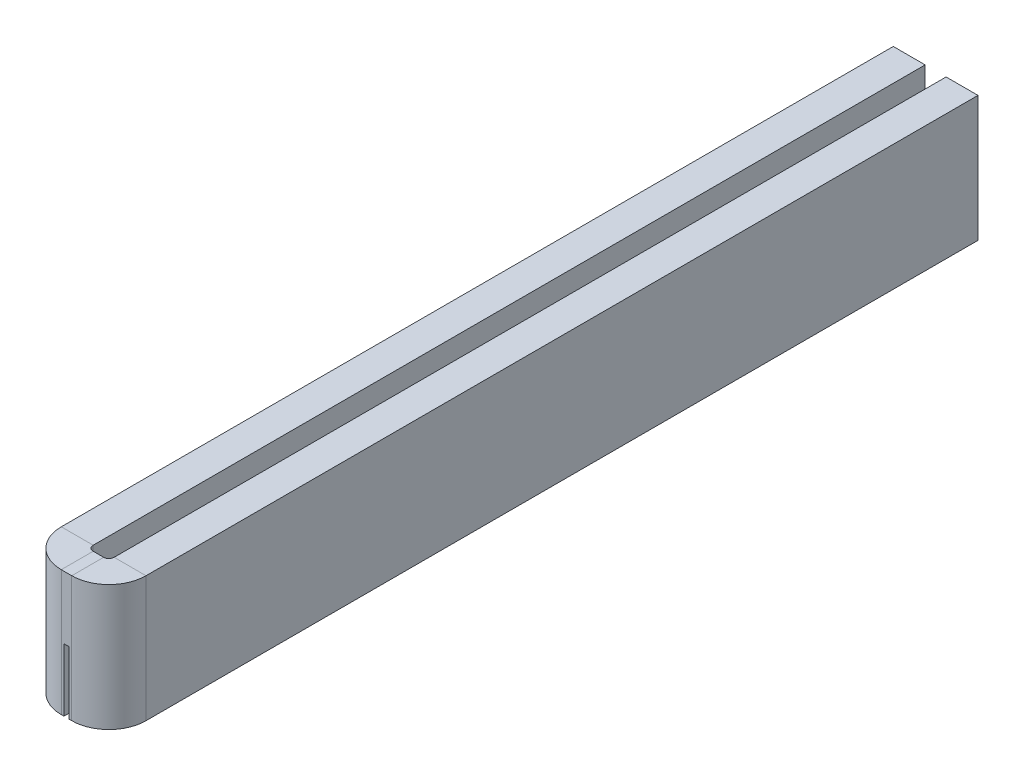
ISO-10303-21;
HEADER;
FILE_DESCRIPTION(('STEP AP214'),'2;1');
FILE_NAME('part.step','',(''),(''),'','','');
FILE_SCHEMA(('AUTOMOTIVE_DESIGN { 1 0 10303 214 1 1 1 1 }'));
ENDSEC;
DATA;
#1=APPLICATION_CONTEXT('core data for automotive mechanical design processes');
#2=APPLICATION_PROTOCOL_DEFINITION('international standard','automotive_design',2000,#1);
#3=PRODUCT_CONTEXT('',#1,'mechanical');
#4=PRODUCT('Part','Part','',(#3));
#5=PRODUCT_RELATED_PRODUCT_CATEGORY('part','',(#4));
#6=PRODUCT_DEFINITION_FORMATION('','',#4);
#7=PRODUCT_DEFINITION_CONTEXT('part definition',#1,'design');
#8=PRODUCT_DEFINITION('design','',#6,#7);
#9=PRODUCT_DEFINITION_SHAPE('','',#8);
#10=(LENGTH_UNIT() NAMED_UNIT(*) SI_UNIT(.MILLI.,.METRE.));
#11=(NAMED_UNIT(*) PLANE_ANGLE_UNIT() SI_UNIT($,.RADIAN.));
#12=(NAMED_UNIT(*) SI_UNIT($,.STERADIAN.) SOLID_ANGLE_UNIT());
#13=UNCERTAINTY_MEASURE_WITH_UNIT(LENGTH_MEASURE(1.E-05),#10,'distance_accuracy_value','');
#14=(GEOMETRIC_REPRESENTATION_CONTEXT(3) GLOBAL_UNCERTAINTY_ASSIGNED_CONTEXT((#13)) GLOBAL_UNIT_ASSIGNED_CONTEXT((#10,
#11,#12)) REPRESENTATION_CONTEXT('',''));
#15=CARTESIAN_POINT('',(0.,0.,0.));
#16=DIRECTION('',(0.,0.,1.));
#17=DIRECTION('',(1.,0.,0.));
#18=AXIS2_PLACEMENT_3D('',#15,#16,#17);
#19=CARTESIAN_POINT('',(-1.,-6.,0.));
#20=DIRECTION('',(0.,1.,0.));
#21=DIRECTION('',(1.,0.,0.));
#22=AXIS2_PLACEMENT_3D('',#19,#20,#21);
#23=PLANE('',#22);
#24=DIRECTION('',(0.,0.,1.));
#25=VECTOR('',#24,1.);
#26=CARTESIAN_POINT('',(0.250000000000001,-6.,-80.));
#27=LINE('',#26,#25);
#28=CARTESIAN_POINT('',(0.250000000000001,-6.,0.));
#29=VERTEX_POINT('',#28);
#30=CARTESIAN_POINT('',(0.250000000000001,-6.,3.048));
#31=VERTEX_POINT('',#30);
#32=EDGE_CURVE('E173',#29,#31,#27,.T.);
#33=ORIENTED_EDGE('',*,*,#32,.F.);
#34=DIRECTION('',(1.,0.,0.));
#35=VECTOR('',#34,1.);
#36=CARTESIAN_POINT('',(-1.,-6.,0.));
#37=LINE('',#36,#35);
#38=CARTESIAN_POINT('',(0.5,-6.,0.));
#39=VERTEX_POINT('',#38);
#40=EDGE_CURVE('E119',#29,#39,#37,.T.);
#41=ORIENTED_EDGE('',*,*,#40,.T.);
#42=DIRECTION('',(0.,0.,1.));
#43=VECTOR('',#42,1.);
#44=CARTESIAN_POINT('',(0.5,-6.,0.));
#45=LINE('',#44,#43);
#46=CARTESIAN_POINT('',(0.5,-6.,3.048));
#47=VERTEX_POINT('',#46);
#48=EDGE_CURVE('E296',#39,#47,#45,.T.);
#49=ORIENTED_EDGE('',*,*,#48,.T.);
#50=DIRECTION('',(-1.,0.,0.));
#51=VECTOR('',#50,1.);
#52=CARTESIAN_POINT('',(-1.,-6.,3.048));
#53=LINE('',#52,#51);
#54=EDGE_CURVE('E62',#31,#47,#53,.F.);
#55=ORIENTED_EDGE('',*,*,#54,.F.);
#56=EDGE_LOOP('',(#33,#41,#49,#55));
#57=FACE_BOUND('',#56,.T.);
#58=ADVANCED_FACE('F38',(#57),#23,.F.);
#59=DIRECTION('',(0.,0.,1.));
#60=VECTOR('',#59,1.);
#61=CARTESIAN_POINT('',(-0.250000000000001,-6.,-80.));
#62=LINE('',#61,#60);
#63=CARTESIAN_POINT('',(-0.250000000000001,-6.,0.));
#64=VERTEX_POINT('',#63);
#65=CARTESIAN_POINT('',(-0.250000000000001,-6.,3.048));
#66=VERTEX_POINT('',#65);
#67=EDGE_CURVE('E182',#64,#66,#62,.T.);
#68=ORIENTED_EDGE('',*,*,#67,.T.);
#69=CARTESIAN_POINT('',(-0.5,-6.,3.048));
#70=VERTEX_POINT('',#69);
#71=EDGE_CURVE('E215',#70,#66,#53,.F.);
#72=ORIENTED_EDGE('',*,*,#71,.F.);
#73=DIRECTION('',(0.,0.,1.));
#74=VECTOR('',#73,1.);
#75=CARTESIAN_POINT('',(-0.5,-6.,0.));
#76=LINE('',#75,#74);
#77=CARTESIAN_POINT('',(-0.5,-6.,0.));
#78=VERTEX_POINT('',#77);
#79=EDGE_CURVE('E298',#78,#70,#76,.T.);
#80=ORIENTED_EDGE('',*,*,#79,.F.);
#81=EDGE_CURVE('E242',#78,#64,#37,.T.);
#82=ORIENTED_EDGE('',*,*,#81,.T.);
#83=EDGE_LOOP('',(#68,#72,#80,#82));
#84=FACE_BOUND('',#83,.T.);
#85=ADVANCED_FACE('F330',(#84),#23,.F.);
#86=CARTESIAN_POINT('',(0.5,-6.,-0.5));
#87=DIRECTION('',(0.,1.,0.));
#88=DIRECTION('',(0.,0.,1.));
#89=AXIS2_PLACEMENT_3D('',#86,#87,#88);
#90=PLANE('',#89);
#91=ORIENTED_EDGE('',*,*,#48,.F.);
#92=CARTESIAN_POINT('',(0.5,-6.,-0.5));
#93=DIRECTION('',(0.,-1.,0.));
#94=DIRECTION('',(0.,0.,-1.));
#95=AXIS2_PLACEMENT_3D('',#92,#93,#94);
#96=CIRCLE('',#95,0.5);
#97=CARTESIAN_POINT('',(1.,-6.,-0.5));
#98=VERTEX_POINT('',#97);
#99=EDGE_CURVE('E181',#39,#98,#96,.F.);
#100=ORIENTED_EDGE('',*,*,#99,.T.);
#101=DIRECTION('',(1.,0.,0.));
#102=VECTOR('',#101,1.);
#103=CARTESIAN_POINT('',(1.,-6.,-0.5));
#104=LINE('',#103,#102);
#105=CARTESIAN_POINT('',(4.048,-6.,-0.5));
#106=VERTEX_POINT('',#105);
#107=EDGE_CURVE('E293',#98,#106,#104,.T.);
#108=ORIENTED_EDGE('',*,*,#107,.T.);
#109=CARTESIAN_POINT('',(0.5,-6.,-0.5));
#110=DIRECTION('',(0.,-1.,0.));
#111=DIRECTION('',(0.,0.,-1.));
#112=AXIS2_PLACEMENT_3D('',#109,#110,#111);
#113=CIRCLE('',#112,3.548);
#114=EDGE_CURVE('E219',#47,#106,#113,.F.);
#115=ORIENTED_EDGE('',*,*,#114,.F.);
#116=EDGE_LOOP('',(#91,#100,#108,#115));
#117=FACE_BOUND('',#116,.T.);
#118=ADVANCED_FACE('F311',(#117),#90,.F.);
#119=CARTESIAN_POINT('',(1.,-6.,0.));
#120=DIRECTION('',(0.,1.,0.));
#121=DIRECTION('',(0.,0.,-1.));
#122=AXIS2_PLACEMENT_3D('',#119,#120,#121);
#123=PLANE('',#122);
#124=ORIENTED_EDGE('',*,*,#107,.F.);
#125=DIRECTION('',(0.,0.,-1.));
#126=VECTOR('',#125,1.);
#127=CARTESIAN_POINT('',(1.,-6.,0.));
#128=LINE('',#127,#126);
#129=CARTESIAN_POINT('',(1.,-6.,-80.));
#130=VERTEX_POINT('',#129);
#131=EDGE_CURVE('E233',#98,#130,#128,.T.);
#132=ORIENTED_EDGE('',*,*,#131,.T.);
#133=DIRECTION('',(1.,0.,0.));
#134=VECTOR('',#133,1.);
#135=CARTESIAN_POINT('',(1.,-6.,-80.));
#136=LINE('',#135,#134);
#137=CARTESIAN_POINT('',(4.048,-6.,-80.));
#138=VERTEX_POINT('',#137);
#139=EDGE_CURVE('E126',#130,#138,#136,.T.);
#140=ORIENTED_EDGE('',*,*,#139,.T.);
#141=DIRECTION('',(0.,0.,1.));
#142=VECTOR('',#141,1.);
#143=CARTESIAN_POINT('',(4.048,-6.,0.));
#144=LINE('',#143,#142);
#145=EDGE_CURVE('E211',#106,#138,#144,.F.);
#146=ORIENTED_EDGE('',*,*,#145,.F.);
#147=EDGE_LOOP('',(#124,#132,#140,#146));
#148=FACE_BOUND('',#147,.T.);
#149=ADVANCED_FACE('F372',(#148),#123,.F.);
#150=CARTESIAN_POINT('',(1.,6.,-80.));
#151=DIRECTION('',(0.,0.,-1.));
#152=DIRECTION('',(0.,-1.,0.));
#153=AXIS2_PLACEMENT_3D('',#150,#151,#152);
#154=PLANE('',#153);
#155=ORIENTED_EDGE('',*,*,#139,.F.);
#156=DIRECTION('',(0.,-1.,0.));
#157=VECTOR('',#156,1.);
#158=CARTESIAN_POINT('',(1.,6.,-80.));
#159=LINE('',#158,#157);
#160=CARTESIAN_POINT('',(1.,6.,-80.));
#161=VERTEX_POINT('',#160);
#162=EDGE_CURVE('E235',#161,#130,#159,.T.);
#163=ORIENTED_EDGE('',*,*,#162,.F.);
#164=DIRECTION('',(1.,0.,0.));
#165=VECTOR('',#164,1.);
#166=CARTESIAN_POINT('',(1.,6.,-80.));
#167=LINE('',#166,#165);
#168=CARTESIAN_POINT('',(4.048,6.,-80.));
#169=VERTEX_POINT('',#168);
#170=EDGE_CURVE('E290',#161,#169,#167,.T.);
#171=ORIENTED_EDGE('',*,*,#170,.T.);
#172=DIRECTION('',(0.,1.,0.));
#173=VECTOR('',#172,1.);
#174=CARTESIAN_POINT('',(4.048,6.,-80.));
#175=LINE('',#174,#173);
#176=EDGE_CURVE('E223',#169,#138,#175,.F.);
#177=ORIENTED_EDGE('',*,*,#176,.T.);
#178=EDGE_LOOP('',(#155,#163,#171,#177));
#179=FACE_BOUND('',#178,.T.);
#180=ADVANCED_FACE('F368',(#179),#154,.T.);
#181=CARTESIAN_POINT('',(1.,6.,0.));
#182=DIRECTION('',(0.,1.,0.));
#183=DIRECTION('',(0.,0.,-1.));
#184=AXIS2_PLACEMENT_3D('',#181,#182,#183);
#185=PLANE('',#184);
#186=ORIENTED_EDGE('',*,*,#170,.F.);
#187=DIRECTION('',(0.,0.,-1.));
#188=VECTOR('',#187,1.);
#189=CARTESIAN_POINT('',(1.,6.,0.));
#190=LINE('',#189,#188);
#191=CARTESIAN_POINT('',(1.,6.,-0.5));
#192=VERTEX_POINT('',#191);
#193=EDGE_CURVE('E239',#192,#161,#190,.T.);
#194=ORIENTED_EDGE('',*,*,#193,.F.);
#195=DIRECTION('',(1.,0.,0.));
#196=VECTOR('',#195,1.);
#197=CARTESIAN_POINT('',(1.,6.,-0.5));
#198=LINE('',#197,#196);
#199=CARTESIAN_POINT('',(4.048,6.,-0.5));
#200=VERTEX_POINT('',#199);
#201=EDGE_CURVE('E288',#192,#200,#198,.T.);
#202=ORIENTED_EDGE('',*,*,#201,.T.);
#203=DIRECTION('',(0.,0.,1.));
#204=VECTOR('',#203,1.);
#205=CARTESIAN_POINT('',(4.048,6.,0.));
#206=LINE('',#205,#204);
#207=EDGE_CURVE('E220',#200,#169,#206,.F.);
#208=ORIENTED_EDGE('',*,*,#207,.T.);
#209=EDGE_LOOP('',(#186,#194,#202,#208));
#210=FACE_BOUND('',#209,.T.);
#211=ADVANCED_FACE('F362',(#210),#185,.T.);
#212=CARTESIAN_POINT('',(0.5,6.,-0.5));
#213=DIRECTION('',(0.,-1.,0.));
#214=DIRECTION('',(0.,0.,-1.));
#215=AXIS2_PLACEMENT_3D('',#212,#213,#214);
#216=PLANE('',#215);
#217=ORIENTED_EDGE('',*,*,#201,.F.);
#218=CARTESIAN_POINT('',(0.5,6.,-0.5));
#219=DIRECTION('',(0.,1.,0.));
#220=DIRECTION('',(0.,0.,1.));
#221=AXIS2_PLACEMENT_3D('',#218,#219,#220);
#222=CIRCLE('',#221,0.5);
#223=CARTESIAN_POINT('',(0.5,6.,0.));
#224=VERTEX_POINT('',#223);
#225=EDGE_CURVE('E267',#192,#224,#222,.F.);
#226=ORIENTED_EDGE('',*,*,#225,.T.);
#227=DIRECTION('',(0.,0.,1.));
#228=VECTOR('',#227,1.);
#229=CARTESIAN_POINT('',(0.5,6.,0.));
#230=LINE('',#229,#228);
#231=CARTESIAN_POINT('',(0.5,6.,3.048));
#232=VERTEX_POINT('',#231);
#233=EDGE_CURVE('E286',#224,#232,#230,.T.);
#234=ORIENTED_EDGE('',*,*,#233,.T.);
#235=CARTESIAN_POINT('',(0.5,6.,-0.5));
#236=DIRECTION('',(0.,-1.,0.));
#237=DIRECTION('',(0.,0.,-1.));
#238=AXIS2_PLACEMENT_3D('',#235,#236,#237);
#239=CIRCLE('',#238,3.548);
#240=EDGE_CURVE('E216',#200,#232,#239,.T.);
#241=ORIENTED_EDGE('',*,*,#240,.F.);
#242=EDGE_LOOP('',(#217,#226,#234,#241));
#243=FACE_BOUND('',#242,.T.);
#244=ADVANCED_FACE('F355',(#243),#216,.F.);
#245=CARTESIAN_POINT('',(-1.,6.,0.));
#246=DIRECTION('',(0.,1.,0.));
#247=DIRECTION('',(1.,0.,0.));
#248=AXIS2_PLACEMENT_3D('',#245,#246,#247);
#249=PLANE('',#248);
#250=ORIENTED_EDGE('',*,*,#233,.F.);
#251=DIRECTION('',(1.,0.,0.));
#252=VECTOR('',#251,1.);
#253=CARTESIAN_POINT('',(-1.,6.,0.));
#254=LINE('',#253,#252);
#255=CARTESIAN_POINT('',(-0.5,6.,0.));
#256=VERTEX_POINT('',#255);
#257=EDGE_CURVE('E245',#256,#224,#254,.T.);
#258=ORIENTED_EDGE('',*,*,#257,.F.);
#259=DIRECTION('',(0.,0.,1.));
#260=VECTOR('',#259,1.);
#261=CARTESIAN_POINT('',(-0.5,6.,0.));
#262=LINE('',#261,#260);
#263=CARTESIAN_POINT('',(-0.5,6.,3.048));
#264=VERTEX_POINT('',#263);
#265=EDGE_CURVE('E284',#256,#264,#262,.T.);
#266=ORIENTED_EDGE('',*,*,#265,.T.);
#267=DIRECTION('',(-1.,0.,0.));
#268=VECTOR('',#267,1.);
#269=CARTESIAN_POINT('',(-1.,6.,3.048));
#270=LINE('',#269,#268);
#271=EDGE_CURVE('E203',#264,#232,#270,.F.);
#272=ORIENTED_EDGE('',*,*,#271,.T.);
#273=EDGE_LOOP('',(#250,#258,#266,#272));
#274=FACE_BOUND('',#273,.T.);
#275=ADVANCED_FACE('F351',(#274),#249,.T.);
#276=CARTESIAN_POINT('',(-0.5,6.,-0.5));
#277=DIRECTION('',(0.,-1.,0.));
#278=DIRECTION('',(0.,0.,-1.));
#279=AXIS2_PLACEMENT_3D('',#276,#277,#278);
#280=PLANE('',#279);
#281=ORIENTED_EDGE('',*,*,#265,.F.);
#282=CARTESIAN_POINT('',(-0.5,6.,-0.5));
#283=DIRECTION('',(0.,1.,0.));
#284=DIRECTION('',(0.,0.,1.));
#285=AXIS2_PLACEMENT_3D('',#282,#283,#284);
#286=CIRCLE('',#285,0.5);
#287=CARTESIAN_POINT('',(-1.,6.,-0.5));
#288=VERTEX_POINT('',#287);
#289=EDGE_CURVE('E236',#256,#288,#286,.F.);
#290=ORIENTED_EDGE('',*,*,#289,.T.);
#291=DIRECTION('',(-1.,0.,0.));
#292=VECTOR('',#291,1.);
#293=CARTESIAN_POINT('',(-1.,6.,-0.5));
#294=LINE('',#293,#292);
#295=CARTESIAN_POINT('',(-4.048,6.,-0.499999999999999));
#296=VERTEX_POINT('',#295);
#297=EDGE_CURVE('E282',#288,#296,#294,.T.);
#298=ORIENTED_EDGE('',*,*,#297,.T.);
#299=CARTESIAN_POINT('',(-0.5,6.,-0.5));
#300=DIRECTION('',(0.,-1.,0.));
#301=DIRECTION('',(0.,0.,-1.));
#302=AXIS2_PLACEMENT_3D('',#299,#300,#301);
#303=CIRCLE('',#302,3.548);
#304=EDGE_CURVE('E208',#264,#296,#303,.T.);
#305=ORIENTED_EDGE('',*,*,#304,.F.);
#306=EDGE_LOOP('',(#281,#290,#298,#305));
#307=FACE_BOUND('',#306,.T.);
#308=ADVANCED_FACE('F321',(#307),#280,.F.);
#309=CARTESIAN_POINT('',(-1.,6.,0.));
#310=DIRECTION('',(0.,1.,0.));
#311=DIRECTION('',(0.,0.,1.));
#312=AXIS2_PLACEMENT_3D('',#309,#310,#311);
#313=PLANE('',#312);
#314=ORIENTED_EDGE('',*,*,#297,.F.);
#315=DIRECTION('',(0.,0.,1.));
#316=VECTOR('',#315,1.);
#317=CARTESIAN_POINT('',(-1.,6.,0.));
#318=LINE('',#317,#316);
#319=CARTESIAN_POINT('',(-1.,6.,-80.));
#320=VERTEX_POINT('',#319);
#321=EDGE_CURVE('E251',#320,#288,#318,.T.);
#322=ORIENTED_EDGE('',*,*,#321,.F.);
#323=DIRECTION('',(-1.,0.,0.));
#324=VECTOR('',#323,1.);
#325=CARTESIAN_POINT('',(-1.,6.,-80.));
#326=LINE('',#325,#324);
#327=CARTESIAN_POINT('',(-4.048,6.,-80.));
#328=VERTEX_POINT('',#327);
#329=EDGE_CURVE('E280',#320,#328,#326,.T.);
#330=ORIENTED_EDGE('',*,*,#329,.T.);
#331=DIRECTION('',(0.,0.,-1.));
#332=VECTOR('',#331,1.);
#333=CARTESIAN_POINT('',(-4.048,6.,0.));
#334=LINE('',#333,#332);
#335=EDGE_CURVE('E202',#328,#296,#334,.F.);
#336=ORIENTED_EDGE('',*,*,#335,.T.);
#337=EDGE_LOOP('',(#314,#322,#330,#336));
#338=FACE_BOUND('',#337,.T.);
#339=ADVANCED_FACE('F349',(#338),#313,.T.);
#340=CARTESIAN_POINT('',(-1.,6.,-80.));
#341=DIRECTION('',(0.,0.,1.));
#342=DIRECTION('',(0.,-1.,0.));
#343=AXIS2_PLACEMENT_3D('',#340,#341,#342);
#344=PLANE('',#343);
#345=ORIENTED_EDGE('',*,*,#329,.F.);
#346=DIRECTION('',(0.,-1.,0.));
#347=VECTOR('',#346,1.);
#348=CARTESIAN_POINT('',(-1.,6.,-80.));
#349=LINE('',#348,#347);
#350=CARTESIAN_POINT('',(-1.,-6.,-80.));
#351=VERTEX_POINT('',#350);
#352=EDGE_CURVE('E254',#320,#351,#349,.T.);
#353=ORIENTED_EDGE('',*,*,#352,.T.);
#354=DIRECTION('',(-1.,0.,0.));
#355=VECTOR('',#354,1.);
#356=CARTESIAN_POINT('',(-1.,-6.,-80.));
#357=LINE('',#356,#355);
#358=CARTESIAN_POINT('',(-4.048,-6.,-80.));
#359=VERTEX_POINT('',#358);
#360=EDGE_CURVE('E278',#351,#359,#357,.T.);
#361=ORIENTED_EDGE('',*,*,#360,.T.);
#362=DIRECTION('',(0.,1.,0.));
#363=VECTOR('',#362,1.);
#364=CARTESIAN_POINT('',(-4.048,6.,-80.));
#365=LINE('',#364,#363);
#366=EDGE_CURVE('E193',#328,#359,#365,.F.);
#367=ORIENTED_EDGE('',*,*,#366,.F.);
#368=EDGE_LOOP('',(#345,#353,#361,#367));
#369=FACE_BOUND('',#368,.T.);
#370=ADVANCED_FACE('F344',(#369),#344,.F.);
#371=CARTESIAN_POINT('',(-1.,-6.,0.));
#372=DIRECTION('',(0.,1.,0.));
#373=DIRECTION('',(0.,0.,1.));
#374=AXIS2_PLACEMENT_3D('',#371,#372,#373);
#375=PLANE('',#374);
#376=ORIENTED_EDGE('',*,*,#360,.F.);
#377=DIRECTION('',(0.,0.,1.));
#378=VECTOR('',#377,1.);
#379=CARTESIAN_POINT('',(-1.,-6.,0.));
#380=LINE('',#379,#378);
#381=CARTESIAN_POINT('',(-1.,-6.,-0.5));
#382=VERTEX_POINT('',#381);
#383=EDGE_CURVE('E248',#351,#382,#380,.T.);
#384=ORIENTED_EDGE('',*,*,#383,.T.);
#385=DIRECTION('',(-1.,0.,0.));
#386=VECTOR('',#385,1.);
#387=CARTESIAN_POINT('',(-1.,-6.,-0.5));
#388=LINE('',#387,#386);
#389=CARTESIAN_POINT('',(-4.048,-6.,-0.5));
#390=VERTEX_POINT('',#389);
#391=EDGE_CURVE('E196',#382,#390,#388,.T.);
#392=ORIENTED_EDGE('',*,*,#391,.T.);
#393=DIRECTION('',(0.,0.,-1.));
#394=VECTOR('',#393,1.);
#395=CARTESIAN_POINT('',(-4.048,-6.,0.));
#396=LINE('',#395,#394);
#397=EDGE_CURVE('E199',#359,#390,#396,.F.);
#398=ORIENTED_EDGE('',*,*,#397,.F.);
#399=EDGE_LOOP('',(#376,#384,#392,#398));
#400=FACE_BOUND('',#399,.T.);
#401=ADVANCED_FACE('F338',(#400),#375,.F.);
#402=CARTESIAN_POINT('',(-0.5,-6.,-0.5));
#403=DIRECTION('',(0.,1.,0.));
#404=DIRECTION('',(0.,0.,1.));
#405=AXIS2_PLACEMENT_3D('',#402,#403,#404);
#406=PLANE('',#405);
#407=CARTESIAN_POINT('',(-0.5,-6.,-0.5));
#408=DIRECTION('',(0.,-1.,0.));
#409=DIRECTION('',(0.,0.,-1.));
#410=AXIS2_PLACEMENT_3D('',#407,#408,#409);
#411=CIRCLE('',#410,0.5);
#412=EDGE_CURVE('E264',#382,#78,#411,.F.);
#413=ORIENTED_EDGE('',*,*,#412,.T.);
#414=ORIENTED_EDGE('',*,*,#79,.T.);
#415=CARTESIAN_POINT('',(-0.5,-6.,-0.5));
#416=DIRECTION('',(0.,-1.,0.));
#417=DIRECTION('',(0.,0.,-1.));
#418=AXIS2_PLACEMENT_3D('',#415,#416,#417);
#419=CIRCLE('',#418,3.548);
#420=EDGE_CURVE('E212',#390,#70,#419,.F.);
#421=ORIENTED_EDGE('',*,*,#420,.F.);
#422=ORIENTED_EDGE('',*,*,#391,.F.);
#423=EDGE_LOOP('',(#413,#414,#421,#422));
#424=FACE_BOUND('',#423,.T.);
#425=ADVANCED_FACE('F40',(#424),#406,.F.);
#426=CARTESIAN_POINT('',(-4.048,6.,0.));
#427=DIRECTION('',(1.,0.,0.));
#428=DIRECTION('',(0.,0.,-1.));
#429=AXIS2_PLACEMENT_3D('',#426,#427,#428);
#430=PLANE('',#429);
#431=ORIENTED_EDGE('',*,*,#397,.T.);
#432=DIRECTION('',(0.,1.,0.));
#433=VECTOR('',#432,1.);
#434=CARTESIAN_POINT('',(-4.048,6.,-0.5));
#435=LINE('',#434,#433);
#436=EDGE_CURVE('E186',#390,#296,#435,.T.);
#437=ORIENTED_EDGE('',*,*,#436,.T.);
#438=ORIENTED_EDGE('',*,*,#335,.F.);
#439=ORIENTED_EDGE('',*,*,#366,.T.);
#440=EDGE_LOOP('',(#431,#437,#438,#439));
#441=FACE_BOUND('',#440,.T.);
#442=ADVANCED_FACE('F477',(#441),#430,.F.);
#443=CARTESIAN_POINT('',(-1.,6.,3.048));
#444=DIRECTION('',(0.,0.,-1.));
#445=DIRECTION('',(-1.,0.,0.));
#446=AXIS2_PLACEMENT_3D('',#443,#444,#445);
#447=PLANE('',#446);
#448=DIRECTION('',(-1.,0.,0.));
#449=VECTOR('',#448,1.);
#450=CARTESIAN_POINT('',(0.25,0.,3.048));
#451=LINE('',#450,#449);
#452=CARTESIAN_POINT('',(0.25,0.,3.048));
#453=VERTEX_POINT('',#452);
#454=CARTESIAN_POINT('',(-0.25,0.,3.048));
#455=VERTEX_POINT('',#454);
#456=EDGE_CURVE('E163',#453,#455,#451,.T.);
#457=ORIENTED_EDGE('',*,*,#456,.F.);
#458=DIRECTION('',(0.,1.,0.));
#459=VECTOR('',#458,1.);
#460=CARTESIAN_POINT('',(0.25,0.,3.048));
#461=LINE('',#460,#459);
#462=EDGE_CURVE('E171',#31,#453,#461,.T.);
#463=ORIENTED_EDGE('',*,*,#462,.F.);
#464=ORIENTED_EDGE('',*,*,#54,.T.);
#465=DIRECTION('',(0.,1.,0.));
#466=VECTOR('',#465,1.);
#467=CARTESIAN_POINT('',(0.5,6.,3.048));
#468=LINE('',#467,#466);
#469=EDGE_CURVE('E194',#47,#232,#468,.T.);
#470=ORIENTED_EDGE('',*,*,#469,.T.);
#471=ORIENTED_EDGE('',*,*,#271,.F.);
#472=DIRECTION('',(0.,1.,0.));
#473=VECTOR('',#472,1.);
#474=CARTESIAN_POINT('',(-0.5,6.,3.048));
#475=LINE('',#474,#473);
#476=EDGE_CURVE('E190',#264,#70,#475,.F.);
#477=ORIENTED_EDGE('',*,*,#476,.T.);
#478=ORIENTED_EDGE('',*,*,#71,.T.);
#479=DIRECTION('',(0.,-1.,0.));
#480=VECTOR('',#479,1.);
#481=CARTESIAN_POINT('',(-0.25,0.,3.048));
#482=LINE('',#481,#480);
#483=EDGE_CURVE('E169',#455,#66,#482,.T.);
#484=ORIENTED_EDGE('',*,*,#483,.F.);
#485=EDGE_LOOP('',(#457,#463,#464,#470,#471,#477,#478,#484));
#486=FACE_BOUND('',#485,.T.);
#487=ADVANCED_FACE('F175',(#486),#447,.F.);
#488=CARTESIAN_POINT('',(4.048,6.,0.));
#489=DIRECTION('',(-1.,0.,0.));
#490=DIRECTION('',(0.,0.,1.));
#491=AXIS2_PLACEMENT_3D('',#488,#489,#490);
#492=PLANE('',#491);
#493=ORIENTED_EDGE('',*,*,#207,.F.);
#494=DIRECTION('',(0.,1.,0.));
#495=VECTOR('',#494,1.);
#496=CARTESIAN_POINT('',(4.048,6.,-0.5));
#497=LINE('',#496,#495);
#498=EDGE_CURVE('E189',#200,#106,#497,.F.);
#499=ORIENTED_EDGE('',*,*,#498,.T.);
#500=ORIENTED_EDGE('',*,*,#145,.T.);
#501=ORIENTED_EDGE('',*,*,#176,.F.);
#502=EDGE_LOOP('',(#493,#499,#500,#501));
#503=FACE_BOUND('',#502,.T.);
#504=ADVANCED_FACE('F371',(#503),#492,.F.);
#505=CARTESIAN_POINT('',(-0.5,6.,-0.5));
#506=DIRECTION('',(0.,-1.,0.));
#507=DIRECTION('',(0.,0.,-1.));
#508=AXIS2_PLACEMENT_3D('',#505,#506,#507);
#509=CYLINDRICAL_SURFACE('',#508,3.548);
#510=ORIENTED_EDGE('',*,*,#304,.T.);
#511=ORIENTED_EDGE('',*,*,#436,.F.);
#512=ORIENTED_EDGE('',*,*,#420,.T.);
#513=ORIENTED_EDGE('',*,*,#476,.F.);
#514=EDGE_LOOP('',(#510,#511,#512,#513));
#515=FACE_BOUND('',#514,.T.);
#516=ADVANCED_FACE('F325',(#515),#509,.T.);
#517=CARTESIAN_POINT('',(0.5,6.,-0.5));
#518=DIRECTION('',(0.,-1.,0.));
#519=DIRECTION('',(0.,0.,-1.));
#520=AXIS2_PLACEMENT_3D('',#517,#518,#519);
#521=CYLINDRICAL_SURFACE('',#520,3.548);
#522=ORIENTED_EDGE('',*,*,#240,.T.);
#523=ORIENTED_EDGE('',*,*,#469,.F.);
#524=ORIENTED_EDGE('',*,*,#114,.T.);
#525=ORIENTED_EDGE('',*,*,#498,.F.);
#526=EDGE_LOOP('',(#522,#523,#524,#525));
#527=FACE_BOUND('',#526,.T.);
#528=ADVANCED_FACE('F314',(#527),#521,.T.);
#529=CARTESIAN_POINT('',(-1.,6.,0.));
#530=DIRECTION('',(1.,0.,0.));
#531=DIRECTION('',(0.,0.,-1.));
#532=AXIS2_PLACEMENT_3D('',#529,#530,#531);
#533=PLANE('',#532);
#534=ORIENTED_EDGE('',*,*,#383,.F.);
#535=ORIENTED_EDGE('',*,*,#352,.F.);
#536=ORIENTED_EDGE('',*,*,#321,.T.);
#537=DIRECTION('',(0.,-1.,0.));
#538=VECTOR('',#537,1.);
#539=CARTESIAN_POINT('',(-1.,6.,-0.5));
#540=LINE('',#539,#538);
#541=EDGE_CURVE('E260',#382,#288,#540,.F.);
#542=ORIENTED_EDGE('',*,*,#541,.F.);
#543=EDGE_LOOP('',(#534,#535,#536,#542));
#544=FACE_BOUND('',#543,.T.);
#545=ADVANCED_FACE('F342',(#544),#533,.T.);
#546=CARTESIAN_POINT('',(-1.,6.,0.));
#547=DIRECTION('',(0.,0.,-1.));
#548=DIRECTION('',(-1.,0.,0.));
#549=AXIS2_PLACEMENT_3D('',#546,#547,#548);
#550=PLANE('',#549);
#551=DIRECTION('',(0.,-1.,0.));
#552=VECTOR('',#551,1.);
#553=CARTESIAN_POINT('',(0.249999999999999,6.,0.));
#554=LINE('',#553,#552);
#555=CARTESIAN_POINT('',(0.25,0.,0.));
#556=VERTEX_POINT('',#555);
#557=EDGE_CURVE('E11',#556,#29,#554,.T.);
#558=ORIENTED_EDGE('',*,*,#557,.F.);
#559=DIRECTION('',(1.,0.,0.));
#560=VECTOR('',#559,1.);
#561=CARTESIAN_POINT('',(-1.,0.,0.));
#562=LINE('',#561,#560);
#563=CARTESIAN_POINT('',(-0.25,0.,0.));
#564=VERTEX_POINT('',#563);
#565=EDGE_CURVE('E166',#564,#556,#562,.T.);
#566=ORIENTED_EDGE('',*,*,#565,.F.);
#567=DIRECTION('',(0.,1.,0.));
#568=VECTOR('',#567,1.);
#569=CARTESIAN_POINT('',(-0.249999999999999,6.,0.));
#570=LINE('',#569,#568);
#571=EDGE_CURVE('E46',#64,#564,#570,.T.);
#572=ORIENTED_EDGE('',*,*,#571,.F.);
#573=ORIENTED_EDGE('',*,*,#81,.F.);
#574=DIRECTION('',(0.,-1.,0.));
#575=VECTOR('',#574,1.);
#576=CARTESIAN_POINT('',(-0.5,6.,0.));
#577=LINE('',#576,#575);
#578=EDGE_CURVE('E257',#256,#78,#577,.T.);
#579=ORIENTED_EDGE('',*,*,#578,.F.);
#580=ORIENTED_EDGE('',*,*,#257,.T.);
#581=DIRECTION('',(0.,-1.,0.));
#582=VECTOR('',#581,1.);
#583=CARTESIAN_POINT('',(0.5,6.,0.));
#584=LINE('',#583,#582);
#585=EDGE_CURVE('E229',#39,#224,#584,.F.);
#586=ORIENTED_EDGE('',*,*,#585,.F.);
#587=ORIENTED_EDGE('',*,*,#40,.F.);
#588=EDGE_LOOP('',(#558,#566,#572,#573,#579,#580,#586,#587));
#589=FACE_BOUND('',#588,.T.);
#590=ADVANCED_FACE('F306',(#589),#550,.T.);
#591=CARTESIAN_POINT('',(1.,6.,0.));
#592=DIRECTION('',(-1.,0.,0.));
#593=DIRECTION('',(0.,0.,1.));
#594=AXIS2_PLACEMENT_3D('',#591,#592,#593);
#595=PLANE('',#594);
#596=ORIENTED_EDGE('',*,*,#193,.T.);
#597=ORIENTED_EDGE('',*,*,#162,.T.);
#598=ORIENTED_EDGE('',*,*,#131,.F.);
#599=DIRECTION('',(0.,-1.,0.));
#600=VECTOR('',#599,1.);
#601=CARTESIAN_POINT('',(1.,6.,-0.5));
#602=LINE('',#601,#600);
#603=EDGE_CURVE('E263',#192,#98,#602,.T.);
#604=ORIENTED_EDGE('',*,*,#603,.F.);
#605=EDGE_LOOP('',(#596,#597,#598,#604));
#606=FACE_BOUND('',#605,.T.);
#607=ADVANCED_FACE('F366',(#606),#595,.T.);
#608=CARTESIAN_POINT('',(-0.5,6.,-0.5));
#609=DIRECTION('',(0.,-1.,0.));
#610=DIRECTION('',(0.,0.,-1.));
#611=AXIS2_PLACEMENT_3D('',#608,#609,#610);
#612=CYLINDRICAL_SURFACE('',#611,0.5);
#613=ORIENTED_EDGE('',*,*,#289,.F.);
#614=ORIENTED_EDGE('',*,*,#578,.T.);
#615=ORIENTED_EDGE('',*,*,#412,.F.);
#616=ORIENTED_EDGE('',*,*,#541,.T.);
#617=EDGE_LOOP('',(#613,#614,#615,#616));
#618=FACE_BOUND('',#617,.T.);
#619=ADVANCED_FACE('F335',(#618),#612,.F.);
#620=CARTESIAN_POINT('',(0.5,6.,-0.5));
#621=DIRECTION('',(0.,-1.,0.));
#622=DIRECTION('',(0.,0.,-1.));
#623=AXIS2_PLACEMENT_3D('',#620,#621,#622);
#624=CYLINDRICAL_SURFACE('',#623,0.5);
#625=ORIENTED_EDGE('',*,*,#225,.F.);
#626=ORIENTED_EDGE('',*,*,#603,.T.);
#627=ORIENTED_EDGE('',*,*,#99,.F.);
#628=ORIENTED_EDGE('',*,*,#585,.T.);
#629=EDGE_LOOP('',(#625,#626,#627,#628));
#630=FACE_BOUND('',#629,.T.);
#631=ADVANCED_FACE('F359',(#630),#624,.F.);
#632=CARTESIAN_POINT('',(0.25,0.,-80.));
#633=DIRECTION('',(1.,0.,0.));
#634=DIRECTION('',(0.,1.,0.));
#635=AXIS2_PLACEMENT_3D('',#632,#633,#634);
#636=PLANE('',#635);
#637=ORIENTED_EDGE('',*,*,#557,.T.);
#638=ORIENTED_EDGE('',*,*,#32,.T.);
#639=ORIENTED_EDGE('',*,*,#462,.T.);
#640=DIRECTION('',(0.,0.,1.));
#641=VECTOR('',#640,1.);
#642=CARTESIAN_POINT('',(0.25,0.,-80.));
#643=LINE('',#642,#641);
#644=EDGE_CURVE('E159',#556,#453,#643,.T.);
#645=ORIENTED_EDGE('',*,*,#644,.F.);
#646=EDGE_LOOP('',(#637,#638,#639,#645));
#647=FACE_BOUND('',#646,.T.);
#648=ADVANCED_FACE('F172',(#647),#636,.F.);
#649=CARTESIAN_POINT('',(-0.25,0.,-80.));
#650=DIRECTION('',(-1.,0.,0.));
#651=DIRECTION('',(0.,-1.,0.));
#652=AXIS2_PLACEMENT_3D('',#649,#650,#651);
#653=PLANE('',#652);
#654=ORIENTED_EDGE('',*,*,#571,.T.);
#655=DIRECTION('',(0.,0.,1.));
#656=VECTOR('',#655,1.);
#657=CARTESIAN_POINT('',(-0.25,0.,-80.));
#658=LINE('',#657,#656);
#659=EDGE_CURVE('E53',#564,#455,#658,.T.);
#660=ORIENTED_EDGE('',*,*,#659,.T.);
#661=ORIENTED_EDGE('',*,*,#483,.T.);
#662=ORIENTED_EDGE('',*,*,#67,.F.);
#663=EDGE_LOOP('',(#654,#660,#661,#662));
#664=FACE_BOUND('',#663,.T.);
#665=ADVANCED_FACE('F303',(#664),#653,.F.);
#666=CARTESIAN_POINT('',(0.25,0.,-80.));
#667=DIRECTION('',(0.,1.,0.));
#668=DIRECTION('',(0.,0.,1.));
#669=AXIS2_PLACEMENT_3D('',#666,#667,#668);
#670=PLANE('',#669);
#671=ORIENTED_EDGE('',*,*,#565,.T.);
#672=ORIENTED_EDGE('',*,*,#644,.T.);
#673=ORIENTED_EDGE('',*,*,#456,.T.);
#674=ORIENTED_EDGE('',*,*,#659,.F.);
#675=EDGE_LOOP('',(#671,#672,#673,#674));
#676=FACE_BOUND('',#675,.T.);
#677=ADVANCED_FACE('F161',(#676),#670,.F.);
#678=CLOSED_SHELL('',(#58,#85,#118,#149,#180,#211,#244,#275,#308,#339,#370,#401,#425,#442,#487,
#504,#516,#528,#545,#590,#607,#619,#631,#648,#665,#677));
#679=MANIFOLD_SOLID_BREP('B2',#678);
#680=ADVANCED_BREP_SHAPE_REPRESENTATION('',(#18,#679),#14);
#681=SHAPE_DEFINITION_REPRESENTATION(#9,#680);
ENDSEC;
END-ISO-10303-21;
